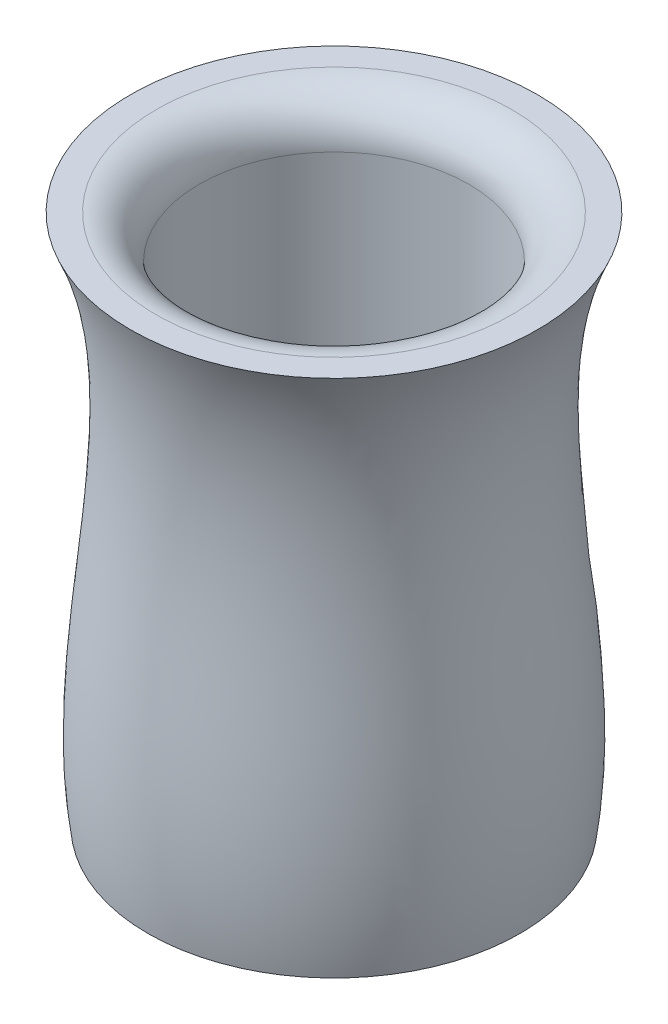
ISO-10303-21;
HEADER;
FILE_DESCRIPTION(('STEP AP214'),'2;1');
FILE_NAME('part.step','',(''),(''),'','','');
FILE_SCHEMA(('AUTOMOTIVE_DESIGN { 1 0 10303 214 1 1 1 1 }'));
ENDSEC;
DATA;
#1=APPLICATION_CONTEXT('core data for automotive mechanical design processes');
#2=APPLICATION_PROTOCOL_DEFINITION('international standard','automotive_design',2000,#1);
#3=PRODUCT_CONTEXT('',#1,'mechanical');
#4=PRODUCT('Part','Part','',(#3));
#5=PRODUCT_RELATED_PRODUCT_CATEGORY('part','',(#4));
#6=PRODUCT_DEFINITION_FORMATION('','',#4);
#7=PRODUCT_DEFINITION_CONTEXT('part definition',#1,'design');
#8=PRODUCT_DEFINITION('design','',#6,#7);
#9=PRODUCT_DEFINITION_SHAPE('','',#8);
#10=(LENGTH_UNIT() NAMED_UNIT(*) SI_UNIT(.MILLI.,.METRE.));
#11=(NAMED_UNIT(*) PLANE_ANGLE_UNIT() SI_UNIT($,.RADIAN.));
#12=(NAMED_UNIT(*) SI_UNIT($,.STERADIAN.) SOLID_ANGLE_UNIT());
#13=UNCERTAINTY_MEASURE_WITH_UNIT(LENGTH_MEASURE(1.E-05),#10,'distance_accuracy_value','');
#14=(GEOMETRIC_REPRESENTATION_CONTEXT(3) GLOBAL_UNCERTAINTY_ASSIGNED_CONTEXT((#13)) GLOBAL_UNIT_ASSIGNED_CONTEXT((#10,
#11,#12)) REPRESENTATION_CONTEXT('',''));
#15=CARTESIAN_POINT('',(0.,0.,0.));
#16=DIRECTION('',(0.,0.,1.));
#17=DIRECTION('',(1.,0.,0.));
#18=AXIS2_PLACEMENT_3D('',#15,#16,#17);
#19=CARTESIAN_POINT('',(47.2370123468381,81.4431247359279,0.));
#20=DIRECTION('',(0.,-1.,0.));
#21=DIRECTION('',(0.,0.,-1.));
#22=AXIS2_PLACEMENT_3D('',#19,#20,#21);
#23=PLANE('',#22);
#24=CARTESIAN_POINT('',(0.,81.4431247359279,0.));
#25=DIRECTION('',(0.,-1.,0.));
#26=DIRECTION('',(0.,0.,-1.));
#27=AXIS2_PLACEMENT_3D('',#24,#25,#26);
#28=CIRCLE('',#27,41.2533837142381);
#29=CARTESIAN_POINT('',(0.,81.4431247359279,-41.2533837142381));
#30=VERTEX_POINT('',#29);
#31=EDGE_CURVE('E10',#30,#30,#28,.T.);
#32=ORIENTED_EDGE('',*,*,#31,.T.);
#33=EDGE_LOOP('',(#32));
#34=FACE_BOUND('',#33,.T.);
#35=CARTESIAN_POINT('',(0.,81.4431247359279,0.));
#36=DIRECTION('',(0.,1.,0.));
#37=DIRECTION('',(0.,0.,1.));
#38=AXIS2_PLACEMENT_3D('',#35,#36,#37);
#39=CIRCLE('',#38,47.2370123468381);
#40=CARTESIAN_POINT('',(0.,81.4431247359279,47.2370123468381));
#41=VERTEX_POINT('',#40);
#42=EDGE_CURVE('E50',#41,#41,#39,.T.);
#43=ORIENTED_EDGE('',*,*,#42,.T.);
#44=EDGE_LOOP('',(#43));
#45=FACE_BOUND('',#44,.T.);
#46=ADVANCED_FACE('F37',(#34,#45),#23,.F.);
#47=CARTESIAN_POINT('',(43.1648561100418,-41.9432092390028,0.));
#48=CARTESIAN_POINT('',(49.2983671049333,-1.23899990926831,0.));
#49=CARTESIAN_POINT('',(30.3818876419934,43.9021651660465,0.));
#50=CARTESIAN_POINT('',(47.2370123468381,81.4431247359279,0.));
#51=B_SPLINE_CURVE_WITH_KNOTS('',3,(#47,#48,#49,#50),.UNSPECIFIED.,.F.,.F.,(4,4),(0.,1.),.UNSPECIFIED.);
#52=CARTESIAN_POINT('',(0.,86.7369278437632,0.));
#53=DIRECTION('',(0.,1.,0.));
#54=AXIS1_PLACEMENT('',#52,#53);
#55=SURFACE_OF_REVOLUTION('',#51,#54);
#56=ORIENTED_EDGE('',*,*,#42,.F.);
#57=EDGE_LOOP('',(#56));
#58=FACE_BOUND('',#57,.T.);
#59=CARTESIAN_POINT('',(0.,-41.9432092390028,0.));
#60=DIRECTION('',(0.,1.,0.));
#61=DIRECTION('',(0.,0.,1.));
#62=AXIS2_PLACEMENT_3D('',#59,#60,#61);
#63=CIRCLE('',#62,43.1648561100418);
#64=CARTESIAN_POINT('',(0.,-41.9432092390028,43.1648561100418));
#65=VERTEX_POINT('',#64);
#66=EDGE_CURVE('E55',#65,#65,#63,.T.);
#67=ORIENTED_EDGE('',*,*,#66,.T.);
#68=EDGE_LOOP('',(#67));
#69=FACE_BOUND('',#68,.T.);
#70=ADVANCED_FACE('F70',(#58,#69),#55,.T.);
#71=CARTESIAN_POINT('',(0.,-41.9432092390028,0.));
#72=DIRECTION('',(0.,1.,0.));
#73=DIRECTION('',(0.,0.,1.));
#74=AXIS2_PLACEMENT_3D('',#71,#72,#73);
#75=PLANE('',#74);
#76=ORIENTED_EDGE('',*,*,#66,.F.);
#77=EDGE_LOOP('',(#76));
#78=FACE_BOUND('',#77,.T.);
#79=ADVANCED_FACE('F73',(#78),#75,.F.);
#80=CARTESIAN_POINT('',(0.,-35.5568752640722,0.));
#81=DIRECTION('',(0.,1.,0.));
#82=DIRECTION('',(0.,0.,1.));
#83=AXIS2_PLACEMENT_3D('',#80,#81,#82);
#84=CYLINDRICAL_SURFACE('',#83,31.2533837142381);
#85=CARTESIAN_POINT('',(0.,71.4431247359279,0.));
#86=DIRECTION('',(0.,-1.,0.));
#87=DIRECTION('',(0.,0.,-1.));
#88=AXIS2_PLACEMENT_3D('',#85,#86,#87);
#89=CIRCLE('',#88,31.2533837142381);
#90=CARTESIAN_POINT('',(0.,71.4431247359279,-31.2533837142381));
#91=VERTEX_POINT('',#90);
#92=EDGE_CURVE('E45',#91,#91,#89,.F.);
#93=ORIENTED_EDGE('',*,*,#92,.T.);
#94=EDGE_LOOP('',(#93));
#95=FACE_BOUND('',#94,.T.);
#96=CARTESIAN_POINT('',(0.,-35.5568752640722,0.));
#97=DIRECTION('',(0.,1.,0.));
#98=DIRECTION('',(0.,0.,1.));
#99=AXIS2_PLACEMENT_3D('',#96,#97,#98);
#100=CIRCLE('',#99,31.2533837142381);
#101=CARTESIAN_POINT('',(0.,-35.5568752640722,31.2533837142381));
#102=VERTEX_POINT('',#101);
#103=EDGE_CURVE('E61',#102,#102,#100,.T.);
#104=ORIENTED_EDGE('',*,*,#103,.F.);
#105=EDGE_LOOP('',(#104));
#106=FACE_BOUND('',#105,.T.);
#107=ADVANCED_FACE('F85',(#95,#106),#84,.F.);
#108=CARTESIAN_POINT('',(0.,-35.5568752640722,0.));
#109=DIRECTION('',(0.,1.,0.));
#110=DIRECTION('',(0.,0.,1.));
#111=AXIS2_PLACEMENT_3D('',#108,#109,#110);
#112=PLANE('',#111);
#113=ORIENTED_EDGE('',*,*,#103,.T.);
#114=EDGE_LOOP('',(#113));
#115=FACE_BOUND('',#114,.T.);
#116=ADVANCED_FACE('F89',(#115),#112,.T.);
#117=CARTESIAN_POINT('',(0.,71.4431247359279,0.));
#118=DIRECTION('',(0.,-1.,0.));
#119=DIRECTION('',(0.,0.,-1.));
#120=AXIS2_PLACEMENT_3D('',#117,#118,#119);
#121=TOROIDAL_SURFACE('',#120,41.2533837142381,10.);
#122=ORIENTED_EDGE('',*,*,#31,.F.);
#123=EDGE_LOOP('',(#122));
#124=FACE_BOUND('',#123,.T.);
#125=ORIENTED_EDGE('',*,*,#92,.F.);
#126=EDGE_LOOP('',(#125));
#127=FACE_BOUND('',#126,.T.);
#128=ADVANCED_FACE('F39',(#124,#127),#121,.T.);
#129=CLOSED_SHELL('',(#46,#70,#79,#107,#116,#128));
#130=MANIFOLD_SOLID_BREP('B2',#129);
#131=ADVANCED_BREP_SHAPE_REPRESENTATION('',(#18,#130),#14);
#132=SHAPE_DEFINITION_REPRESENTATION(#9,#131);
ENDSEC;
END-ISO-10303-21;
